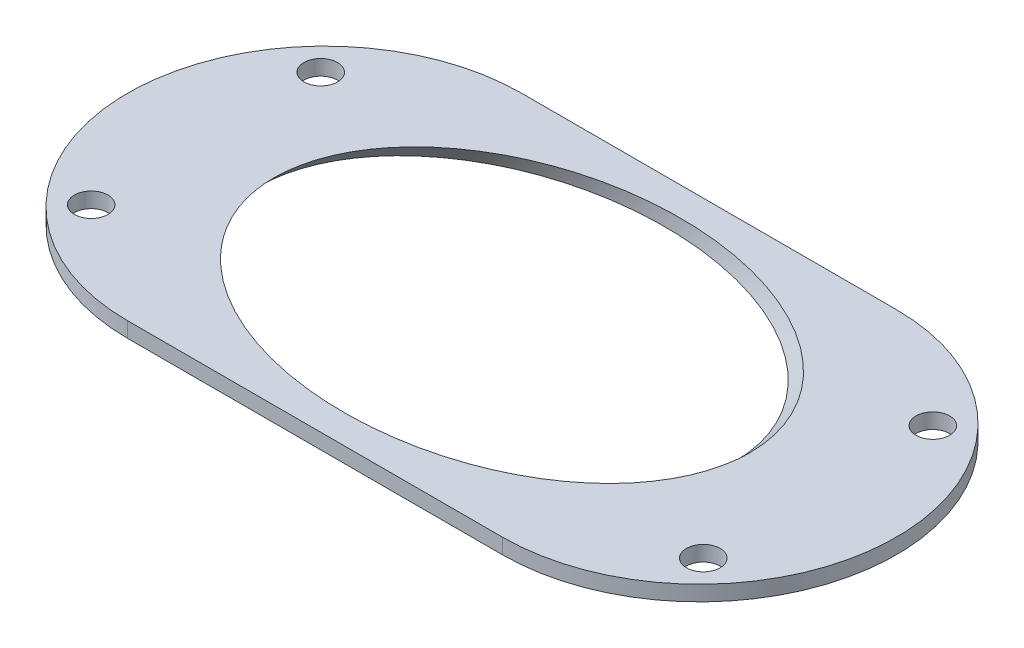
ISO-10303-21;
HEADER;
FILE_DESCRIPTION(('STEP AP214'),'2;1');
FILE_NAME('part.step','',(''),(''),'','','');
FILE_SCHEMA(('AUTOMOTIVE_DESIGN { 1 0 10303 214 1 1 1 1 }'));
ENDSEC;
DATA;
#1=APPLICATION_CONTEXT('core data for automotive mechanical design processes');
#2=APPLICATION_PROTOCOL_DEFINITION('international standard','automotive_design',2000,#1);
#3=PRODUCT_CONTEXT('',#1,'mechanical');
#4=PRODUCT('Part','Part','',(#3));
#5=PRODUCT_RELATED_PRODUCT_CATEGORY('part','',(#4));
#6=PRODUCT_DEFINITION_FORMATION('','',#4);
#7=PRODUCT_DEFINITION_CONTEXT('part definition',#1,'design');
#8=PRODUCT_DEFINITION('design','',#6,#7);
#9=PRODUCT_DEFINITION_SHAPE('','',#8);
#10=(LENGTH_UNIT() NAMED_UNIT(*) SI_UNIT(.MILLI.,.METRE.));
#11=(NAMED_UNIT(*) PLANE_ANGLE_UNIT() SI_UNIT($,.RADIAN.));
#12=(NAMED_UNIT(*) SI_UNIT($,.STERADIAN.) SOLID_ANGLE_UNIT());
#13=UNCERTAINTY_MEASURE_WITH_UNIT(LENGTH_MEASURE(1.E-05),#10,'distance_accuracy_value','');
#14=(GEOMETRIC_REPRESENTATION_CONTEXT(3) GLOBAL_UNCERTAINTY_ASSIGNED_CONTEXT((#13)) GLOBAL_UNIT_ASSIGNED_CONTEXT((#10,
#11,#12)) REPRESENTATION_CONTEXT('',''));
#15=CARTESIAN_POINT('',(0.,0.,0.));
#16=DIRECTION('',(0.,0.,1.));
#17=DIRECTION('',(1.,0.,0.));
#18=AXIS2_PLACEMENT_3D('',#15,#16,#17);
#19=CARTESIAN_POINT('',(-12.25,1.,0.));
#20=DIRECTION('',(0.,-1.,0.));
#21=DIRECTION('',(0.,0.,-1.));
#22=AXIS2_PLACEMENT_3D('',#19,#20,#21);
#23=CYLINDRICAL_SURFACE('',#22,12.875);
#24=CARTESIAN_POINT('',(-12.25,0.,0.));
#25=DIRECTION('',(0.,1.,0.));
#26=DIRECTION('',(0.,0.,1.));
#27=AXIS2_PLACEMENT_3D('',#24,#25,#26);
#28=CIRCLE('',#27,12.875);
#29=CARTESIAN_POINT('',(-12.25,0.,-12.875));
#30=VERTEX_POINT('',#29);
#31=CARTESIAN_POINT('',(-12.25,0.,12.875));
#32=VERTEX_POINT('',#31);
#33=EDGE_CURVE('E101',#30,#32,#28,.T.);
#34=ORIENTED_EDGE('',*,*,#33,.T.);
#35=DIRECTION('',(0.,-1.,0.));
#36=VECTOR('',#35,1.);
#37=CARTESIAN_POINT('',(-12.25,1.,12.875));
#38=LINE('',#37,#36);
#39=CARTESIAN_POINT('',(-12.25,1.,12.875));
#40=VERTEX_POINT('',#39);
#41=EDGE_CURVE('E11',#40,#32,#38,.T.);
#42=ORIENTED_EDGE('',*,*,#41,.F.);
#43=CARTESIAN_POINT('',(-12.25,1.,0.));
#44=DIRECTION('',(0.,1.,0.));
#45=DIRECTION('',(0.,0.,1.));
#46=AXIS2_PLACEMENT_3D('',#43,#44,#45);
#47=CIRCLE('',#46,12.875);
#48=CARTESIAN_POINT('',(-12.25,1.,-12.875));
#49=VERTEX_POINT('',#48);
#50=EDGE_CURVE('E88',#49,#40,#47,.T.);
#51=ORIENTED_EDGE('',*,*,#50,.F.);
#52=DIRECTION('',(0.,-1.,0.));
#53=VECTOR('',#52,1.);
#54=CARTESIAN_POINT('',(-12.25,1.,-12.875));
#55=LINE('',#54,#53);
#56=EDGE_CURVE('E97',#49,#30,#55,.T.);
#57=ORIENTED_EDGE('',*,*,#56,.T.);
#58=EDGE_LOOP('',(#34,#42,#51,#57));
#59=FACE_BOUND('',#58,.T.);
#60=ADVANCED_FACE('F36',(#59),#23,.T.);
#61=CARTESIAN_POINT('',(-12.25,1.,12.875));
#62=DIRECTION('',(0.,0.,-1.));
#63=DIRECTION('',(-1.,0.,0.));
#64=AXIS2_PLACEMENT_3D('',#61,#62,#63);
#65=PLANE('',#64);
#66=DIRECTION('',(1.,0.,0.));
#67=VECTOR('',#66,1.);
#68=CARTESIAN_POINT('',(-12.25,0.,12.875));
#69=LINE('',#68,#67);
#70=CARTESIAN_POINT('',(12.25,0.,12.875));
#71=VERTEX_POINT('',#70);
#72=EDGE_CURVE('E92',#32,#71,#69,.T.);
#73=ORIENTED_EDGE('',*,*,#72,.T.);
#74=DIRECTION('',(0.,-1.,0.));
#75=VECTOR('',#74,1.);
#76=CARTESIAN_POINT('',(12.25,1.,12.875));
#77=LINE('',#76,#75);
#78=CARTESIAN_POINT('',(12.25,1.,12.875));
#79=VERTEX_POINT('',#78);
#80=EDGE_CURVE('E45',#79,#71,#77,.T.);
#81=ORIENTED_EDGE('',*,*,#80,.F.);
#82=DIRECTION('',(1.,0.,0.));
#83=VECTOR('',#82,1.);
#84=CARTESIAN_POINT('',(-12.25,1.,12.875));
#85=LINE('',#84,#83);
#86=EDGE_CURVE('E83',#40,#79,#85,.T.);
#87=ORIENTED_EDGE('',*,*,#86,.F.);
#88=ORIENTED_EDGE('',*,*,#41,.T.);
#89=EDGE_LOOP('',(#73,#81,#87,#88));
#90=FACE_BOUND('',#89,.T.);
#91=ADVANCED_FACE('F91',(#90),#65,.F.);
#92=CARTESIAN_POINT('',(12.25,1.,0.));
#93=DIRECTION('',(0.,-1.,0.));
#94=DIRECTION('',(0.,0.,-1.));
#95=AXIS2_PLACEMENT_3D('',#92,#93,#94);
#96=CYLINDRICAL_SURFACE('',#95,12.875);
#97=CARTESIAN_POINT('',(12.25,0.,0.));
#98=DIRECTION('',(0.,1.,0.));
#99=DIRECTION('',(0.,0.,1.));
#100=AXIS2_PLACEMENT_3D('',#97,#98,#99);
#101=CIRCLE('',#100,12.875);
#102=CARTESIAN_POINT('',(12.25,0.,-12.875));
#103=VERTEX_POINT('',#102);
#104=EDGE_CURVE('E70',#71,#103,#101,.T.);
#105=ORIENTED_EDGE('',*,*,#104,.T.);
#106=DIRECTION('',(0.,-1.,0.));
#107=VECTOR('',#106,1.);
#108=CARTESIAN_POINT('',(12.25,1.,-12.875));
#109=LINE('',#108,#107);
#110=CARTESIAN_POINT('',(12.25,1.,-12.875));
#111=VERTEX_POINT('',#110);
#112=EDGE_CURVE('E93',#111,#103,#109,.T.);
#113=ORIENTED_EDGE('',*,*,#112,.F.);
#114=CARTESIAN_POINT('',(12.25,1.,0.));
#115=DIRECTION('',(0.,1.,0.));
#116=DIRECTION('',(0.,0.,1.));
#117=AXIS2_PLACEMENT_3D('',#114,#115,#116);
#118=CIRCLE('',#117,12.875);
#119=EDGE_CURVE('E86',#79,#111,#118,.T.);
#120=ORIENTED_EDGE('',*,*,#119,.F.);
#121=ORIENTED_EDGE('',*,*,#80,.T.);
#122=EDGE_LOOP('',(#105,#113,#120,#121));
#123=FACE_BOUND('',#122,.T.);
#124=ADVANCED_FACE('F95',(#123),#96,.T.);
#125=CARTESIAN_POINT('',(-12.25,1.,-12.875));
#126=DIRECTION('',(0.,0.,1.));
#127=DIRECTION('',(1.,0.,0.));
#128=AXIS2_PLACEMENT_3D('',#125,#126,#127);
#129=PLANE('',#128);
#130=DIRECTION('',(-1.,0.,0.));
#131=VECTOR('',#130,1.);
#132=CARTESIAN_POINT('',(-12.25,0.,-12.875));
#133=LINE('',#132,#131);
#134=EDGE_CURVE('E76',#103,#30,#133,.T.);
#135=ORIENTED_EDGE('',*,*,#134,.T.);
#136=ORIENTED_EDGE('',*,*,#56,.F.);
#137=DIRECTION('',(-1.,0.,0.));
#138=VECTOR('',#137,1.);
#139=CARTESIAN_POINT('',(-12.25,1.,-12.875));
#140=LINE('',#139,#138);
#141=EDGE_CURVE('E53',#111,#49,#140,.T.);
#142=ORIENTED_EDGE('',*,*,#141,.F.);
#143=ORIENTED_EDGE('',*,*,#112,.T.);
#144=EDGE_LOOP('',(#135,#136,#142,#143));
#145=FACE_BOUND('',#144,.T.);
#146=ADVANCED_FACE('F109',(#145),#129,.F.);
#147=CARTESIAN_POINT('',(-12.25,1.,0.));
#148=DIRECTION('',(0.,1.,0.));
#149=DIRECTION('',(0.,0.,1.));
#150=AXIS2_PLACEMENT_3D('',#147,#148,#149);
#151=PLANE('',#150);
#152=CARTESIAN_POINT('',(-20.,1.,-7.5));
#153=DIRECTION('',(0.,1.,0.));
#154=DIRECTION('',(0.,0.,1.));
#155=AXIS2_PLACEMENT_3D('',#152,#153,#154);
#156=CIRCLE('',#155,1.09999999999999);
#157=CARTESIAN_POINT('',(-20.,1.,-6.40000000000001));
#158=VERTEX_POINT('',#157);
#159=EDGE_CURVE('E138',#158,#158,#156,.T.);
#160=ORIENTED_EDGE('',*,*,#159,.F.);
#161=EDGE_LOOP('',(#160));
#162=FACE_BOUND('',#161,.T.);
#163=CARTESIAN_POINT('',(-20.,1.,7.5));
#164=DIRECTION('',(0.,1.,0.));
#165=DIRECTION('',(0.,0.,1.));
#166=AXIS2_PLACEMENT_3D('',#163,#164,#165);
#167=CIRCLE('',#166,1.09999999999999);
#168=CARTESIAN_POINT('',(-20.,1.,8.59999999999999));
#169=VERTEX_POINT('',#168);
#170=EDGE_CURVE('E132',#169,#169,#167,.T.);
#171=ORIENTED_EDGE('',*,*,#170,.F.);
#172=EDGE_LOOP('',(#171));
#173=FACE_BOUND('',#172,.T.);
#174=CARTESIAN_POINT('',(20.,1.,7.5));
#175=DIRECTION('',(0.,1.,0.));
#176=DIRECTION('',(0.,0.,1.));
#177=AXIS2_PLACEMENT_3D('',#174,#175,#176);
#178=CIRCLE('',#177,1.09999999999999);
#179=CARTESIAN_POINT('',(20.,1.,8.59999999999999));
#180=VERTEX_POINT('',#179);
#181=EDGE_CURVE('E126',#180,#180,#178,.T.);
#182=ORIENTED_EDGE('',*,*,#181,.F.);
#183=EDGE_LOOP('',(#182));
#184=FACE_BOUND('',#183,.T.);
#185=CARTESIAN_POINT('',(20.,1.,-7.5));
#186=DIRECTION('',(0.,1.,0.));
#187=DIRECTION('',(0.,0.,1.));
#188=AXIS2_PLACEMENT_3D('',#185,#186,#187);
#189=CIRCLE('',#188,1.09999999999999);
#190=CARTESIAN_POINT('',(20.,1.,-6.40000000000001));
#191=VERTEX_POINT('',#190);
#192=EDGE_CURVE('E120',#191,#191,#189,.T.);
#193=ORIENTED_EDGE('',*,*,#192,.F.);
#194=EDGE_LOOP('',(#193));
#195=FACE_BOUND('',#194,.T.);
#196=CARTESIAN_POINT('',(0.,0.999999999999999,0.));
#197=DIRECTION('',(0.,1.,0.));
#198=DIRECTION('',(1.,0.,0.));
#199=AXIS2_PLACEMENT_3D('',#196,#197,#198);
#200=ELLIPSE('',#199,15.5563491861041,11.);
#201=CARTESIAN_POINT('',(15.5563491861041,0.999999999999999,0.));
#202=VERTEX_POINT('',#201);
#203=EDGE_CURVE('E104',#202,#202,#200,.T.);
#204=ORIENTED_EDGE('',*,*,#203,.F.);
#205=EDGE_LOOP('',(#204));
#206=FACE_BOUND('',#205,.T.);
#207=ORIENTED_EDGE('',*,*,#50,.T.);
#208=ORIENTED_EDGE('',*,*,#86,.T.);
#209=ORIENTED_EDGE('',*,*,#119,.T.);
#210=ORIENTED_EDGE('',*,*,#141,.T.);
#211=EDGE_LOOP('',(#207,#208,#209,#210));
#212=FACE_BOUND('',#211,.T.);
#213=ADVANCED_FACE('F84',(#162,#173,#184,#195,#206,#212),#151,.T.);
#214=CARTESIAN_POINT('',(-12.25,0.,0.));
#215=DIRECTION('',(0.,1.,0.));
#216=DIRECTION('',(0.,0.,1.));
#217=AXIS2_PLACEMENT_3D('',#214,#215,#216);
#218=PLANE('',#217);
#219=CARTESIAN_POINT('',(-20.,0.,-7.5));
#220=DIRECTION('',(0.,1.,0.));
#221=DIRECTION('',(0.,0.,1.));
#222=AXIS2_PLACEMENT_3D('',#219,#220,#221);
#223=CIRCLE('',#222,1.09999999999999);
#224=CARTESIAN_POINT('',(-20.,0.,-6.4));
#225=VERTEX_POINT('',#224);
#226=EDGE_CURVE('E135',#225,#225,#223,.T.);
#227=ORIENTED_EDGE('',*,*,#226,.T.);
#228=EDGE_LOOP('',(#227));
#229=FACE_BOUND('',#228,.T.);
#230=CARTESIAN_POINT('',(-20.,0.,7.5));
#231=DIRECTION('',(0.,1.,0.));
#232=DIRECTION('',(0.,0.,1.));
#233=AXIS2_PLACEMENT_3D('',#230,#231,#232);
#234=CIRCLE('',#233,1.09999999999999);
#235=CARTESIAN_POINT('',(-20.,0.,8.6));
#236=VERTEX_POINT('',#235);
#237=EDGE_CURVE('E129',#236,#236,#234,.T.);
#238=ORIENTED_EDGE('',*,*,#237,.T.);
#239=EDGE_LOOP('',(#238));
#240=FACE_BOUND('',#239,.T.);
#241=CARTESIAN_POINT('',(20.,0.,7.5));
#242=DIRECTION('',(0.,1.,0.));
#243=DIRECTION('',(0.,0.,1.));
#244=AXIS2_PLACEMENT_3D('',#241,#242,#243);
#245=CIRCLE('',#244,1.09999999999999);
#246=CARTESIAN_POINT('',(20.,0.,8.6));
#247=VERTEX_POINT('',#246);
#248=EDGE_CURVE('E123',#247,#247,#245,.T.);
#249=ORIENTED_EDGE('',*,*,#248,.T.);
#250=EDGE_LOOP('',(#249));
#251=FACE_BOUND('',#250,.T.);
#252=CARTESIAN_POINT('',(20.,0.,-7.5));
#253=DIRECTION('',(0.,1.,0.));
#254=DIRECTION('',(0.,0.,1.));
#255=AXIS2_PLACEMENT_3D('',#252,#253,#254);
#256=CIRCLE('',#255,1.09999999999999);
#257=CARTESIAN_POINT('',(20.,0.,-6.4));
#258=VERTEX_POINT('',#257);
#259=EDGE_CURVE('E117',#258,#258,#256,.T.);
#260=ORIENTED_EDGE('',*,*,#259,.T.);
#261=EDGE_LOOP('',(#260));
#262=FACE_BOUND('',#261,.T.);
#263=CARTESIAN_POINT('',(-1.,0.,0.));
#264=DIRECTION('',(0.,1.,0.));
#265=DIRECTION('',(1.,0.,0.));
#266=AXIS2_PLACEMENT_3D('',#263,#264,#265);
#267=ELLIPSE('',#266,15.5563491861041,11.);
#268=CARTESIAN_POINT('',(14.5563491861041,0.,0.));
#269=VERTEX_POINT('',#268);
#270=EDGE_CURVE('E39',#269,#269,#267,.T.);
#271=ORIENTED_EDGE('',*,*,#270,.T.);
#272=EDGE_LOOP('',(#271));
#273=FACE_BOUND('',#272,.T.);
#274=ORIENTED_EDGE('',*,*,#33,.F.);
#275=ORIENTED_EDGE('',*,*,#134,.F.);
#276=ORIENTED_EDGE('',*,*,#104,.F.);
#277=ORIENTED_EDGE('',*,*,#72,.F.);
#278=EDGE_LOOP('',(#274,#275,#276,#277));
#279=FACE_BOUND('',#278,.T.);
#280=ADVANCED_FACE('F112',(#229,#240,#251,#262,#273,#279),#218,.F.);
#281=CARTESIAN_POINT('',(-13.0625,-12.0625,0.));
#282=DIRECTION('',(0.707106781186549,0.707106781186546,0.));
#283=DIRECTION('',(-0.707106781186546,0.707106781186549,0.));
#284=AXIS2_PLACEMENT_3D('',#281,#282,#283);
#285=CYLINDRICAL_SURFACE('',#284,11.);
#286=ORIENTED_EDGE('',*,*,#203,.T.);
#287=EDGE_LOOP('',(#286));
#288=FACE_BOUND('',#287,.T.);
#289=ORIENTED_EDGE('',*,*,#270,.F.);
#290=EDGE_LOOP('',(#289));
#291=FACE_BOUND('',#290,.T.);
#292=ADVANCED_FACE('F155',(#288,#291),#285,.F.);
#293=CARTESIAN_POINT('',(20.,1.,-7.5));
#294=DIRECTION('',(0.,1.,0.));
#295=DIRECTION('',(0.,0.,1.));
#296=AXIS2_PLACEMENT_3D('',#293,#294,#295);
#297=CYLINDRICAL_SURFACE('',#296,1.09999999999999);
#298=ORIENTED_EDGE('',*,*,#259,.F.);
#299=EDGE_LOOP('',(#298));
#300=FACE_BOUND('',#299,.T.);
#301=ORIENTED_EDGE('',*,*,#192,.T.);
#302=EDGE_LOOP('',(#301));
#303=FACE_BOUND('',#302,.T.);
#304=ADVANCED_FACE('F158',(#300,#303),#297,.F.);
#305=CARTESIAN_POINT('',(20.,1.,7.5));
#306=DIRECTION('',(0.,1.,0.));
#307=DIRECTION('',(0.,0.,1.));
#308=AXIS2_PLACEMENT_3D('',#305,#306,#307);
#309=CYLINDRICAL_SURFACE('',#308,1.09999999999999);
#310=ORIENTED_EDGE('',*,*,#248,.F.);
#311=EDGE_LOOP('',(#310));
#312=FACE_BOUND('',#311,.T.);
#313=ORIENTED_EDGE('',*,*,#181,.T.);
#314=EDGE_LOOP('',(#313));
#315=FACE_BOUND('',#314,.T.);
#316=ADVANCED_FACE('F203',(#312,#315),#309,.F.);
#317=CARTESIAN_POINT('',(-20.,1.,7.5));
#318=DIRECTION('',(0.,1.,0.));
#319=DIRECTION('',(0.,0.,1.));
#320=AXIS2_PLACEMENT_3D('',#317,#318,#319);
#321=CYLINDRICAL_SURFACE('',#320,1.09999999999999);
#322=ORIENTED_EDGE('',*,*,#237,.F.);
#323=EDGE_LOOP('',(#322));
#324=FACE_BOUND('',#323,.T.);
#325=ORIENTED_EDGE('',*,*,#170,.T.);
#326=EDGE_LOOP('',(#325));
#327=FACE_BOUND('',#326,.T.);
#328=ADVANCED_FACE('F213',(#324,#327),#321,.F.);
#329=CARTESIAN_POINT('',(-20.,1.,-7.5));
#330=DIRECTION('',(0.,1.,0.));
#331=DIRECTION('',(0.,0.,1.));
#332=AXIS2_PLACEMENT_3D('',#329,#330,#331);
#333=CYLINDRICAL_SURFACE('',#332,1.09999999999999);
#334=ORIENTED_EDGE('',*,*,#226,.F.);
#335=EDGE_LOOP('',(#334));
#336=FACE_BOUND('',#335,.T.);
#337=ORIENTED_EDGE('',*,*,#159,.T.);
#338=EDGE_LOOP('',(#337));
#339=FACE_BOUND('',#338,.T.);
#340=ADVANCED_FACE('F142',(#336,#339),#333,.F.);
#341=CLOSED_SHELL('',(#60,#91,#124,#146,#213,#280,#292,#304,#316,#328,#340));
#342=MANIFOLD_SOLID_BREP('B2',#341);
#343=ADVANCED_BREP_SHAPE_REPRESENTATION('',(#18,#342),#14);
#344=SHAPE_DEFINITION_REPRESENTATION(#9,#343);
ENDSEC;
END-ISO-10303-21;
